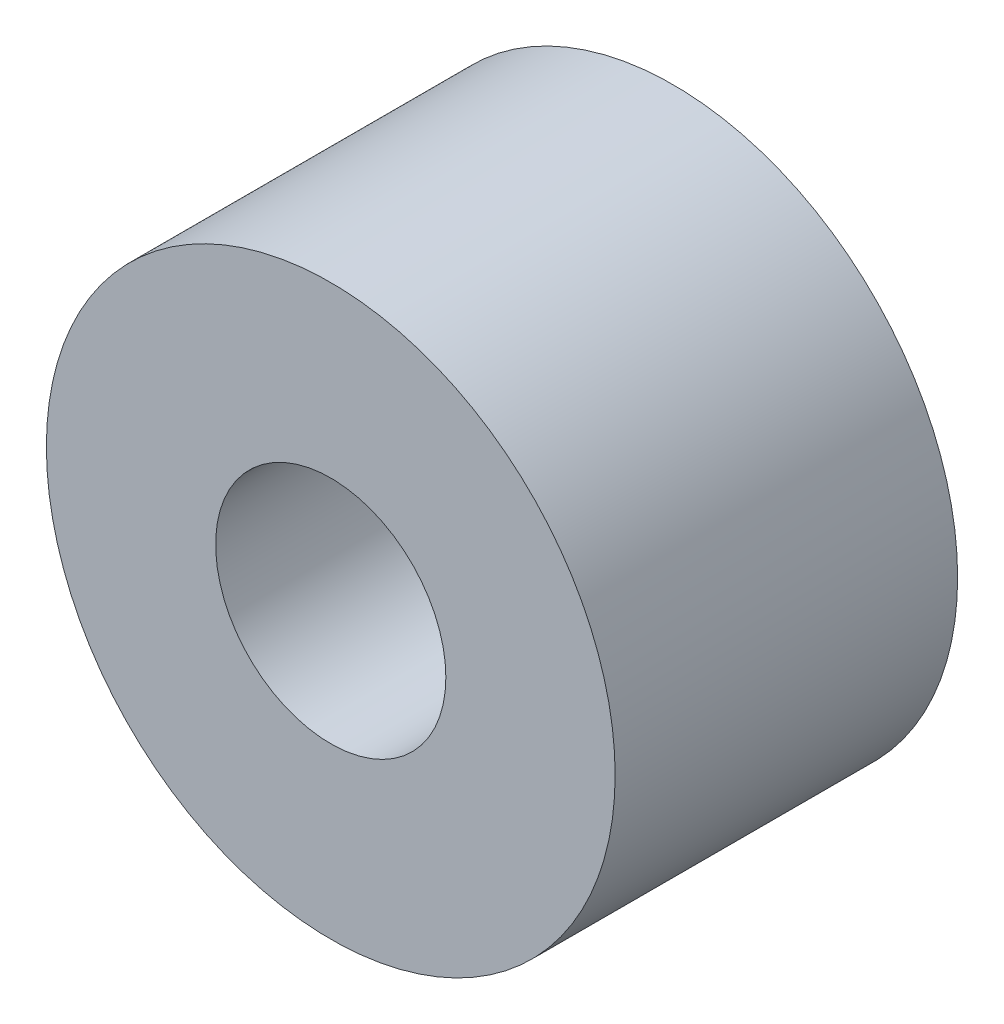
ISO-10303-21;
HEADER;
FILE_DESCRIPTION(('STEP AP214'),'2;1');
FILE_NAME('part.step','',(''),(''),'','','');
FILE_SCHEMA(('AUTOMOTIVE_DESIGN { 1 0 10303 214 1 1 1 1 }'));
ENDSEC;
DATA;
#1=APPLICATION_CONTEXT('core data for automotive mechanical design processes');
#2=APPLICATION_PROTOCOL_DEFINITION('international standard','automotive_design',2000,#1);
#3=PRODUCT_CONTEXT('',#1,'mechanical');
#4=PRODUCT('Part','Part','',(#3));
#5=PRODUCT_RELATED_PRODUCT_CATEGORY('part','',(#4));
#6=PRODUCT_DEFINITION_FORMATION('','',#4);
#7=PRODUCT_DEFINITION_CONTEXT('part definition',#1,'design');
#8=PRODUCT_DEFINITION('design','',#6,#7);
#9=PRODUCT_DEFINITION_SHAPE('','',#8);
#10=(LENGTH_UNIT() NAMED_UNIT(*) SI_UNIT(.MILLI.,.METRE.));
#11=(NAMED_UNIT(*) PLANE_ANGLE_UNIT() SI_UNIT($,.RADIAN.));
#12=(NAMED_UNIT(*) SI_UNIT($,.STERADIAN.) SOLID_ANGLE_UNIT());
#13=UNCERTAINTY_MEASURE_WITH_UNIT(LENGTH_MEASURE(1.E-05),#10,'distance_accuracy_value','');
#14=(GEOMETRIC_REPRESENTATION_CONTEXT(3) GLOBAL_UNCERTAINTY_ASSIGNED_CONTEXT((#13)) GLOBAL_UNIT_ASSIGNED_CONTEXT((#10,
#11,#12)) REPRESENTATION_CONTEXT('',''));
#15=CARTESIAN_POINT('',(0.,0.,0.));
#16=DIRECTION('',(0.,0.,1.));
#17=DIRECTION('',(1.,0.,0.));
#18=AXIS2_PLACEMENT_3D('',#15,#16,#17);
#19=CARTESIAN_POINT('',(0.,0.,0.));
#20=DIRECTION('',(0.,0.,1.));
#21=DIRECTION('',(1.,0.,0.));
#22=AXIS2_PLACEMENT_3D('',#19,#20,#21);
#23=CYLINDRICAL_SURFACE('',#22,5.25);
#24=CARTESIAN_POINT('',(0.,0.,6.8225));
#25=DIRECTION('',(0.,0.,1.));
#26=DIRECTION('',(1.,0.,0.));
#27=AXIS2_PLACEMENT_3D('',#24,#25,#26);
#28=CIRCLE('',#27,5.25);
#29=CARTESIAN_POINT('',(5.25,0.,6.8225));
#30=VERTEX_POINT('',#29);
#31=EDGE_CURVE('E41',#30,#30,#28,.T.);
#32=ORIENTED_EDGE('',*,*,#31,.F.);
#33=EDGE_LOOP('',(#32));
#34=FACE_BOUND('',#33,.T.);
#35=CARTESIAN_POINT('',(0.,0.,0.5));
#36=DIRECTION('',(0.,0.,-1.));
#37=DIRECTION('',(-1.,0.,0.));
#38=AXIS2_PLACEMENT_3D('',#35,#36,#37);
#39=CIRCLE('',#38,5.25);
#40=CARTESIAN_POINT('',(-5.25,0.,0.500000000000001));
#41=VERTEX_POINT('',#40);
#42=EDGE_CURVE('E49',#41,#41,#39,.T.);
#43=ORIENTED_EDGE('',*,*,#42,.F.);
#44=EDGE_LOOP('',(#43));
#45=FACE_BOUND('',#44,.T.);
#46=ADVANCED_FACE('F34',(#34,#45),#23,.T.);
#47=CARTESIAN_POINT('',(5.25,0.,0.));
#48=DIRECTION('',(0.,0.,-1.));
#49=DIRECTION('',(-1.,0.,0.));
#50=AXIS2_PLACEMENT_3D('',#47,#48,#49);
#51=PLANE('',#50);
#52=CARTESIAN_POINT('',(0.,0.,0.));
#53=DIRECTION('',(0.,0.,1.));
#54=DIRECTION('',(1.,0.,0.));
#55=AXIS2_PLACEMENT_3D('',#52,#53,#54);
#56=CIRCLE('',#55,2.125);
#57=CARTESIAN_POINT('',(2.125,0.,0.));
#58=VERTEX_POINT('',#57);
#59=EDGE_CURVE('E10',#58,#58,#56,.T.);
#60=ORIENTED_EDGE('',*,*,#59,.T.);
#61=EDGE_LOOP('',(#60));
#62=FACE_BOUND('',#61,.T.);
#63=CARTESIAN_POINT('',(0.,0.,0.));
#64=DIRECTION('',(0.,0.,-1.));
#65=DIRECTION('',(-1.,0.,0.));
#66=AXIS2_PLACEMENT_3D('',#63,#64,#65);
#67=CIRCLE('',#66,3.);
#68=CARTESIAN_POINT('',(-3.,0.,0.));
#69=VERTEX_POINT('',#68);
#70=EDGE_CURVE('E55',#69,#69,#67,.T.);
#71=ORIENTED_EDGE('',*,*,#70,.T.);
#72=EDGE_LOOP('',(#71));
#73=FACE_BOUND('',#72,.T.);
#74=ADVANCED_FACE('F72',(#62,#73),#51,.T.);
#75=CARTESIAN_POINT('',(0.,0.,0.));
#76=DIRECTION('',(0.,0.,1.));
#77=DIRECTION('',(1.,0.,0.));
#78=AXIS2_PLACEMENT_3D('',#75,#76,#77);
#79=CYLINDRICAL_SURFACE('',#78,2.125);
#80=ORIENTED_EDGE('',*,*,#59,.F.);
#81=EDGE_LOOP('',(#80));
#82=FACE_BOUND('',#81,.T.);
#83=CARTESIAN_POINT('',(0.,0.,6.8225));
#84=DIRECTION('',(0.,0.,1.));
#85=DIRECTION('',(1.,0.,0.));
#86=AXIS2_PLACEMENT_3D('',#83,#84,#85);
#87=CIRCLE('',#86,2.125);
#88=CARTESIAN_POINT('',(2.125,0.,6.8225));
#89=VERTEX_POINT('',#88);
#90=EDGE_CURVE('E45',#89,#89,#87,.T.);
#91=ORIENTED_EDGE('',*,*,#90,.T.);
#92=EDGE_LOOP('',(#91));
#93=FACE_BOUND('',#92,.T.);
#94=ADVANCED_FACE('F36',(#82,#93),#79,.F.);
#95=CARTESIAN_POINT('',(0.,0.,6.8225));
#96=DIRECTION('',(0.,0.,1.));
#97=DIRECTION('',(1.,0.,0.));
#98=AXIS2_PLACEMENT_3D('',#95,#96,#97);
#99=PLANE('',#98);
#100=ORIENTED_EDGE('',*,*,#31,.T.);
#101=EDGE_LOOP('',(#100));
#102=FACE_BOUND('',#101,.T.);
#103=ORIENTED_EDGE('',*,*,#90,.F.);
#104=EDGE_LOOP('',(#103));
#105=FACE_BOUND('',#104,.T.);
#106=ADVANCED_FACE('F67',(#102,#105),#99,.T.);
#107=CARTESIAN_POINT('',(0.,0.,0.5));
#108=DIRECTION('',(0.,0.,-1.));
#109=DIRECTION('',(-1.,0.,0.));
#110=AXIS2_PLACEMENT_3D('',#107,#108,#109);
#111=PLANE('',#110);
#112=CARTESIAN_POINT('',(0.,0.,0.5));
#113=DIRECTION('',(0.,0.,-1.));
#114=DIRECTION('',(-1.,0.,0.));
#115=AXIS2_PLACEMENT_3D('',#112,#113,#114);
#116=CIRCLE('',#115,3.);
#117=CARTESIAN_POINT('',(-3.,0.,0.5));
#118=VERTEX_POINT('',#117);
#119=EDGE_CURVE('E54',#118,#118,#116,.T.);
#120=ORIENTED_EDGE('',*,*,#119,.F.);
#121=EDGE_LOOP('',(#120));
#122=FACE_BOUND('',#121,.T.);
#123=ORIENTED_EDGE('',*,*,#42,.T.);
#124=EDGE_LOOP('',(#123));
#125=FACE_BOUND('',#124,.T.);
#126=ADVANCED_FACE('F64',(#122,#125),#111,.T.);
#127=CARTESIAN_POINT('',(0.,0.,0.5));
#128=DIRECTION('',(0.,0.,-1.));
#129=DIRECTION('',(-1.,0.,0.));
#130=AXIS2_PLACEMENT_3D('',#127,#128,#129);
#131=CYLINDRICAL_SURFACE('',#130,3.);
#132=ORIENTED_EDGE('',*,*,#119,.T.);
#133=EDGE_LOOP('',(#132));
#134=FACE_BOUND('',#133,.T.);
#135=ORIENTED_EDGE('',*,*,#70,.F.);
#136=EDGE_LOOP('',(#135));
#137=FACE_BOUND('',#136,.T.);
#138=ADVANCED_FACE('F61',(#134,#137),#131,.T.);
#139=CLOSED_SHELL('',(#46,#74,#94,#106,#126,#138));
#140=MANIFOLD_SOLID_BREP('B2',#139);
#141=ADVANCED_BREP_SHAPE_REPRESENTATION('',(#18,#140),#14);
#142=SHAPE_DEFINITION_REPRESENTATION(#9,#141);
ENDSEC;
END-ISO-10303-21;
